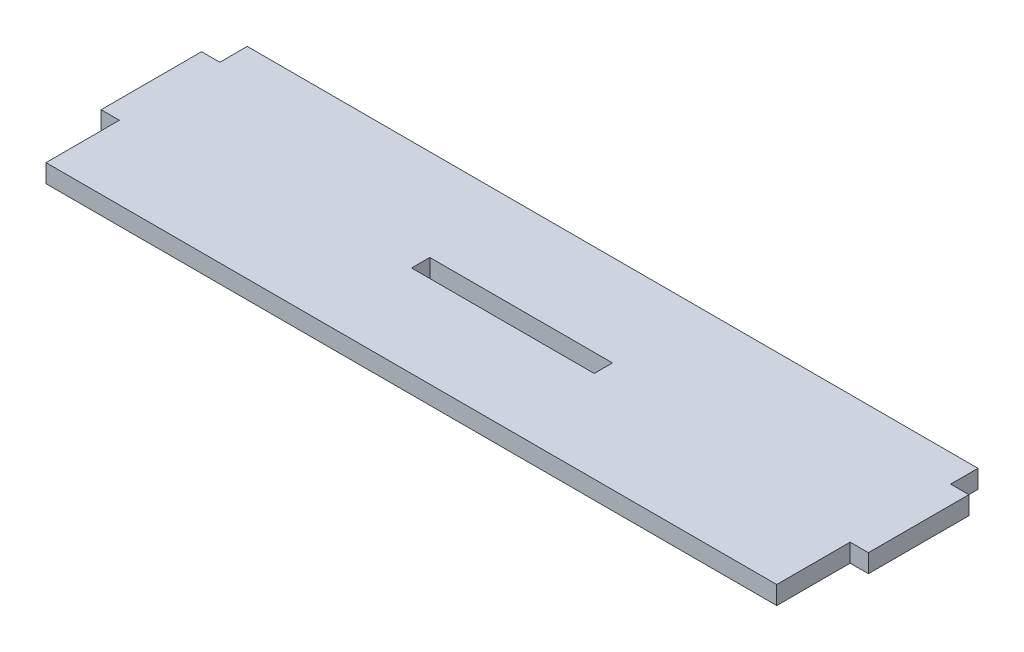
ISO-10303-21;
HEADER;
FILE_DESCRIPTION(('STEP AP214'),'2;1');
FILE_NAME('part.step','',(''),(''),'','','');
FILE_SCHEMA(('AUTOMOTIVE_DESIGN { 1 0 10303 214 1 1 1 1 }'));
ENDSEC;
DATA;
#1=APPLICATION_CONTEXT('core data for automotive mechanical design processes');
#2=APPLICATION_PROTOCOL_DEFINITION('international standard','automotive_design',2000,#1);
#3=PRODUCT_CONTEXT('',#1,'mechanical');
#4=PRODUCT('Part','Part','',(#3));
#5=PRODUCT_RELATED_PRODUCT_CATEGORY('part','',(#4));
#6=PRODUCT_DEFINITION_FORMATION('','',#4);
#7=PRODUCT_DEFINITION_CONTEXT('part definition',#1,'design');
#8=PRODUCT_DEFINITION('design','',#6,#7);
#9=PRODUCT_DEFINITION_SHAPE('','',#8);
#10=(LENGTH_UNIT() NAMED_UNIT(*) SI_UNIT(.MILLI.,.METRE.));
#11=(NAMED_UNIT(*) PLANE_ANGLE_UNIT() SI_UNIT($,.RADIAN.));
#12=(NAMED_UNIT(*) SI_UNIT($,.STERADIAN.) SOLID_ANGLE_UNIT());
#13=UNCERTAINTY_MEASURE_WITH_UNIT(LENGTH_MEASURE(1.E-05),#10,'distance_accuracy_value','');
#14=(GEOMETRIC_REPRESENTATION_CONTEXT(3) GLOBAL_UNCERTAINTY_ASSIGNED_CONTEXT((#13)) GLOBAL_UNIT_ASSIGNED_CONTEXT((#10,
#11,#12)) REPRESENTATION_CONTEXT('',''));
#15=CARTESIAN_POINT('',(0.,0.,0.));
#16=DIRECTION('',(0.,0.,1.));
#17=DIRECTION('',(1.,0.,0.));
#18=AXIS2_PLACEMENT_3D('',#15,#16,#17);
#19=CARTESIAN_POINT('',(0.,4.,0.));
#20=DIRECTION('',(0.,-1.,0.));
#21=DIRECTION('',(0.,0.,-1.));
#22=AXIS2_PLACEMENT_3D('',#19,#20,#21);
#23=PLANE('',#22);
#24=DIRECTION('',(0.,0.,1.));
#25=VECTOR('',#24,1.);
#26=CARTESIAN_POINT('',(0.,4.,0.));
#27=LINE('',#26,#25);
#28=CARTESIAN_POINT('',(0.,4.,0.));
#29=VERTEX_POINT('',#28);
#30=CARTESIAN_POINT('',(0.,4.,6.));
#31=VERTEX_POINT('',#30);
#32=EDGE_CURVE('E211',#29,#31,#27,.T.);
#33=ORIENTED_EDGE('',*,*,#32,.T.);
#34=DIRECTION('',(-1.,0.,0.));
#35=VECTOR('',#34,1.);
#36=CARTESIAN_POINT('',(0.,4.,6.));
#37=LINE('',#36,#35);
#38=CARTESIAN_POINT('',(-4.,4.,6.));
#39=VERTEX_POINT('',#38);
#40=EDGE_CURVE('E215',#31,#39,#37,.T.);
#41=ORIENTED_EDGE('',*,*,#40,.T.);
#42=DIRECTION('',(0.,0.,1.));
#43=VECTOR('',#42,1.);
#44=CARTESIAN_POINT('',(-4.,4.,6.));
#45=LINE('',#44,#43);
#46=CARTESIAN_POINT('',(-4.,4.,28.));
#47=VERTEX_POINT('',#46);
#48=EDGE_CURVE('E219',#39,#47,#45,.T.);
#49=ORIENTED_EDGE('',*,*,#48,.T.);
#50=DIRECTION('',(1.,0.,0.));
#51=VECTOR('',#50,1.);
#52=CARTESIAN_POINT('',(-4.,4.,28.));
#53=LINE('',#52,#51);
#54=CARTESIAN_POINT('',(0.,4.,28.));
#55=VERTEX_POINT('',#54);
#56=EDGE_CURVE('E222',#47,#55,#53,.T.);
#57=ORIENTED_EDGE('',*,*,#56,.T.);
#58=DIRECTION('',(0.,0.,1.));
#59=VECTOR('',#58,1.);
#60=CARTESIAN_POINT('',(0.,4.,28.));
#61=LINE('',#60,#59);
#62=CARTESIAN_POINT('',(0.,4.,44.07));
#63=VERTEX_POINT('',#62);
#64=EDGE_CURVE('E225',#55,#63,#61,.T.);
#65=ORIENTED_EDGE('',*,*,#64,.T.);
#66=DIRECTION('',(1.,0.,0.));
#67=VECTOR('',#66,1.);
#68=CARTESIAN_POINT('',(0.,4.,44.07));
#69=LINE('',#68,#67);
#70=CARTESIAN_POINT('',(160.,4.,44.07));
#71=VERTEX_POINT('',#70);
#72=EDGE_CURVE('E228',#63,#71,#69,.T.);
#73=ORIENTED_EDGE('',*,*,#72,.T.);
#74=DIRECTION('',(0.,0.,-1.));
#75=VECTOR('',#74,1.);
#76=CARTESIAN_POINT('',(160.,4.,28.));
#77=LINE('',#76,#75);
#78=CARTESIAN_POINT('',(160.,4.,28.));
#79=VERTEX_POINT('',#78);
#80=EDGE_CURVE('E231',#71,#79,#77,.T.);
#81=ORIENTED_EDGE('',*,*,#80,.T.);
#82=DIRECTION('',(1.,0.,0.));
#83=VECTOR('',#82,1.);
#84=CARTESIAN_POINT('',(164.,4.,28.));
#85=LINE('',#84,#83);
#86=CARTESIAN_POINT('',(164.,4.,28.));
#87=VERTEX_POINT('',#86);
#88=EDGE_CURVE('E234',#79,#87,#85,.T.);
#89=ORIENTED_EDGE('',*,*,#88,.T.);
#90=DIRECTION('',(0.,0.,-1.));
#91=VECTOR('',#90,1.);
#92=CARTESIAN_POINT('',(164.,4.,5.99999999999998));
#93=LINE('',#92,#91);
#94=CARTESIAN_POINT('',(164.,4.,5.99999999999998));
#95=VERTEX_POINT('',#94);
#96=EDGE_CURVE('E237',#87,#95,#93,.T.);
#97=ORIENTED_EDGE('',*,*,#96,.T.);
#98=DIRECTION('',(-1.,0.,0.));
#99=VECTOR('',#98,1.);
#100=CARTESIAN_POINT('',(160.,4.,5.99999999999998));
#101=LINE('',#100,#99);
#102=CARTESIAN_POINT('',(160.,4.,5.99999999999998));
#103=VERTEX_POINT('',#102);
#104=EDGE_CURVE('E240',#95,#103,#101,.T.);
#105=ORIENTED_EDGE('',*,*,#104,.T.);
#106=DIRECTION('',(0.,0.,-1.));
#107=VECTOR('',#106,1.);
#108=CARTESIAN_POINT('',(160.,4.,0.));
#109=LINE('',#108,#107);
#110=CARTESIAN_POINT('',(160.,4.,0.));
#111=VERTEX_POINT('',#110);
#112=EDGE_CURVE('E243',#103,#111,#109,.T.);
#113=ORIENTED_EDGE('',*,*,#112,.T.);
#114=DIRECTION('',(-1.,0.,0.));
#115=VECTOR('',#114,1.);
#116=CARTESIAN_POINT('',(0.,4.,0.));
#117=LINE('',#116,#115);
#118=EDGE_CURVE('E246',#111,#29,#117,.T.);
#119=ORIENTED_EDGE('',*,*,#118,.T.);
#120=EDGE_LOOP('',(#33,#41,#49,#57,#65,#73,#81,#89,#97,#105,#113,#119));
#121=FACE_BOUND('',#120,.T.);
#122=DIRECTION('',(1.,0.,0.));
#123=VECTOR('',#122,1.);
#124=CARTESIAN_POINT('',(60.,4.,24.035));
#125=LINE('',#124,#123);
#126=CARTESIAN_POINT('',(60.,4.,24.035));
#127=VERTEX_POINT('',#126);
#128=CARTESIAN_POINT('',(100.,4.,24.035));
#129=VERTEX_POINT('',#128);
#130=EDGE_CURVE('E163',#127,#129,#125,.T.);
#131=ORIENTED_EDGE('',*,*,#130,.F.);
#132=DIRECTION('',(0.,0.,1.));
#133=VECTOR('',#132,1.);
#134=CARTESIAN_POINT('',(60.,4.,20.035));
#135=LINE('',#134,#133);
#136=CARTESIAN_POINT('',(60.,4.,20.035));
#137=VERTEX_POINT('',#136);
#138=EDGE_CURVE('E189',#137,#127,#135,.T.);
#139=ORIENTED_EDGE('',*,*,#138,.F.);
#140=DIRECTION('',(-1.,0.,0.));
#141=VECTOR('',#140,1.);
#142=CARTESIAN_POINT('',(60.,4.,20.035));
#143=LINE('',#142,#141);
#144=CARTESIAN_POINT('',(100.,4.,20.035));
#145=VERTEX_POINT('',#144);
#146=EDGE_CURVE('E185',#145,#137,#143,.T.);
#147=ORIENTED_EDGE('',*,*,#146,.F.);
#148=DIRECTION('',(0.,0.,-1.));
#149=VECTOR('',#148,1.);
#150=CARTESIAN_POINT('',(100.,4.,20.035));
#151=LINE('',#150,#149);
#152=EDGE_CURVE('E172',#129,#145,#151,.T.);
#153=ORIENTED_EDGE('',*,*,#152,.F.);
#154=EDGE_LOOP('',(#131,#139,#147,#153));
#155=FACE_BOUND('',#154,.T.);
#156=ADVANCED_FACE('F49',(#121,#155),#23,.F.);
#157=CARTESIAN_POINT('',(0.,0.,0.));
#158=DIRECTION('',(0.,-1.,0.));
#159=DIRECTION('',(0.,0.,-1.));
#160=AXIS2_PLACEMENT_3D('',#157,#158,#159);
#161=PLANE('',#160);
#162=DIRECTION('',(0.,0.,1.));
#163=VECTOR('',#162,1.);
#164=CARTESIAN_POINT('',(0.,0.,0.));
#165=LINE('',#164,#163);
#166=CARTESIAN_POINT('',(0.,0.,0.));
#167=VERTEX_POINT('',#166);
#168=CARTESIAN_POINT('',(0.,0.,6.));
#169=VERTEX_POINT('',#168);
#170=EDGE_CURVE('E181',#167,#169,#165,.T.);
#171=ORIENTED_EDGE('',*,*,#170,.F.);
#172=DIRECTION('',(-1.,0.,0.));
#173=VECTOR('',#172,1.);
#174=CARTESIAN_POINT('',(0.,0.,0.));
#175=LINE('',#174,#173);
#176=CARTESIAN_POINT('',(160.,0.,0.));
#177=VERTEX_POINT('',#176);
#178=EDGE_CURVE('E216',#177,#167,#175,.T.);
#179=ORIENTED_EDGE('',*,*,#178,.F.);
#180=DIRECTION('',(0.,0.,-1.));
#181=VECTOR('',#180,1.);
#182=CARTESIAN_POINT('',(160.,0.,0.));
#183=LINE('',#182,#181);
#184=CARTESIAN_POINT('',(160.,0.,5.99999999999998));
#185=VERTEX_POINT('',#184);
#186=EDGE_CURVE('E280',#185,#177,#183,.T.);
#187=ORIENTED_EDGE('',*,*,#186,.F.);
#188=DIRECTION('',(-1.,0.,0.));
#189=VECTOR('',#188,1.);
#190=CARTESIAN_POINT('',(160.,0.,5.99999999999998));
#191=LINE('',#190,#189);
#192=CARTESIAN_POINT('',(164.,0.,5.99999999999998));
#193=VERTEX_POINT('',#192);
#194=EDGE_CURVE('E277',#193,#185,#191,.T.);
#195=ORIENTED_EDGE('',*,*,#194,.F.);
#196=DIRECTION('',(0.,0.,-1.));
#197=VECTOR('',#196,1.);
#198=CARTESIAN_POINT('',(164.,0.,5.99999999999998));
#199=LINE('',#198,#197);
#200=CARTESIAN_POINT('',(164.,0.,28.));
#201=VERTEX_POINT('',#200);
#202=EDGE_CURVE('E274',#201,#193,#199,.T.);
#203=ORIENTED_EDGE('',*,*,#202,.F.);
#204=DIRECTION('',(1.,0.,0.));
#205=VECTOR('',#204,1.);
#206=CARTESIAN_POINT('',(164.,0.,28.));
#207=LINE('',#206,#205);
#208=CARTESIAN_POINT('',(160.,0.,28.));
#209=VERTEX_POINT('',#208);
#210=EDGE_CURVE('E271',#209,#201,#207,.T.);
#211=ORIENTED_EDGE('',*,*,#210,.F.);
#212=DIRECTION('',(0.,0.,-1.));
#213=VECTOR('',#212,1.);
#214=CARTESIAN_POINT('',(160.,0.,28.));
#215=LINE('',#214,#213);
#216=CARTESIAN_POINT('',(160.,0.,44.07));
#217=VERTEX_POINT('',#216);
#218=EDGE_CURVE('E268',#217,#209,#215,.T.);
#219=ORIENTED_EDGE('',*,*,#218,.F.);
#220=DIRECTION('',(1.,0.,0.));
#221=VECTOR('',#220,1.);
#222=CARTESIAN_POINT('',(0.,0.,44.07));
#223=LINE('',#222,#221);
#224=CARTESIAN_POINT('',(0.,0.,44.07));
#225=VERTEX_POINT('',#224);
#226=EDGE_CURVE('E265',#225,#217,#223,.T.);
#227=ORIENTED_EDGE('',*,*,#226,.F.);
#228=DIRECTION('',(0.,0.,1.));
#229=VECTOR('',#228,1.);
#230=CARTESIAN_POINT('',(0.,0.,28.));
#231=LINE('',#230,#229);
#232=CARTESIAN_POINT('',(0.,0.,28.));
#233=VERTEX_POINT('',#232);
#234=EDGE_CURVE('E262',#233,#225,#231,.T.);
#235=ORIENTED_EDGE('',*,*,#234,.F.);
#236=DIRECTION('',(1.,0.,0.));
#237=VECTOR('',#236,1.);
#238=CARTESIAN_POINT('',(-4.,0.,28.));
#239=LINE('',#238,#237);
#240=CARTESIAN_POINT('',(-4.,0.,28.));
#241=VERTEX_POINT('',#240);
#242=EDGE_CURVE('E259',#241,#233,#239,.T.);
#243=ORIENTED_EDGE('',*,*,#242,.F.);
#244=DIRECTION('',(0.,0.,1.));
#245=VECTOR('',#244,1.);
#246=CARTESIAN_POINT('',(-4.,0.,6.));
#247=LINE('',#246,#245);
#248=CARTESIAN_POINT('',(-4.,0.,6.));
#249=VERTEX_POINT('',#248);
#250=EDGE_CURVE('E256',#249,#241,#247,.T.);
#251=ORIENTED_EDGE('',*,*,#250,.F.);
#252=DIRECTION('',(-1.,0.,0.));
#253=VECTOR('',#252,1.);
#254=CARTESIAN_POINT('',(0.,0.,6.));
#255=LINE('',#254,#253);
#256=EDGE_CURVE('E253',#169,#249,#255,.T.);
#257=ORIENTED_EDGE('',*,*,#256,.F.);
#258=EDGE_LOOP('',(#171,#179,#187,#195,#203,#211,#219,#227,#235,#243,#251,#257));
#259=FACE_BOUND('',#258,.T.);
#260=DIRECTION('',(0.,0.,1.));
#261=VECTOR('',#260,1.);
#262=CARTESIAN_POINT('',(60.,0.,20.035));
#263=LINE('',#262,#261);
#264=CARTESIAN_POINT('',(60.,0.,20.035));
#265=VERTEX_POINT('',#264);
#266=CARTESIAN_POINT('',(60.,0.,24.035));
#267=VERTEX_POINT('',#266);
#268=EDGE_CURVE('E173',#265,#267,#263,.T.);
#269=ORIENTED_EDGE('',*,*,#268,.T.);
#270=DIRECTION('',(1.,0.,0.));
#271=VECTOR('',#270,1.);
#272=CARTESIAN_POINT('',(60.,0.,24.035));
#273=LINE('',#272,#271);
#274=CARTESIAN_POINT('',(100.,0.,24.035));
#275=VERTEX_POINT('',#274);
#276=EDGE_CURVE('E73',#267,#275,#273,.T.);
#277=ORIENTED_EDGE('',*,*,#276,.T.);
#278=DIRECTION('',(0.,0.,-1.));
#279=VECTOR('',#278,1.);
#280=CARTESIAN_POINT('',(100.,0.,20.035));
#281=LINE('',#280,#279);
#282=CARTESIAN_POINT('',(100.,0.,20.035));
#283=VERTEX_POINT('',#282);
#284=EDGE_CURVE('E179',#275,#283,#281,.T.);
#285=ORIENTED_EDGE('',*,*,#284,.T.);
#286=DIRECTION('',(-1.,0.,0.));
#287=VECTOR('',#286,1.);
#288=CARTESIAN_POINT('',(60.,0.,20.035));
#289=LINE('',#288,#287);
#290=EDGE_CURVE('E198',#283,#265,#289,.T.);
#291=ORIENTED_EDGE('',*,*,#290,.T.);
#292=EDGE_LOOP('',(#269,#277,#285,#291));
#293=FACE_BOUND('',#292,.T.);
#294=ADVANCED_FACE('F335',(#259,#293),#161,.T.);
#295=CARTESIAN_POINT('',(0.,4.,0.));
#296=DIRECTION('',(1.,0.,0.));
#297=DIRECTION('',(0.,0.,-1.));
#298=AXIS2_PLACEMENT_3D('',#295,#296,#297);
#299=PLANE('',#298);
#300=ORIENTED_EDGE('',*,*,#170,.T.);
#301=DIRECTION('',(0.,-1.,0.));
#302=VECTOR('',#301,1.);
#303=CARTESIAN_POINT('',(0.,4.,6.));
#304=LINE('',#303,#302);
#305=EDGE_CURVE('E11',#31,#169,#304,.T.);
#306=ORIENTED_EDGE('',*,*,#305,.F.);
#307=ORIENTED_EDGE('',*,*,#32,.F.);
#308=DIRECTION('',(0.,-1.,0.));
#309=VECTOR('',#308,1.);
#310=CARTESIAN_POINT('',(0.,4.,0.));
#311=LINE('',#310,#309);
#312=EDGE_CURVE('E249',#29,#167,#311,.T.);
#313=ORIENTED_EDGE('',*,*,#312,.T.);
#314=EDGE_LOOP('',(#300,#306,#307,#313));
#315=FACE_BOUND('',#314,.T.);
#316=ADVANCED_FACE('F51',(#315),#299,.F.);
#317=CARTESIAN_POINT('',(0.,4.,6.));
#318=DIRECTION('',(0.,0.,1.));
#319=DIRECTION('',(1.,0.,0.));
#320=AXIS2_PLACEMENT_3D('',#317,#318,#319);
#321=PLANE('',#320);
#322=ORIENTED_EDGE('',*,*,#256,.T.);
#323=DIRECTION('',(0.,-1.,0.));
#324=VECTOR('',#323,1.);
#325=CARTESIAN_POINT('',(-4.,4.,6.));
#326=LINE('',#325,#324);
#327=EDGE_CURVE('E58',#39,#249,#326,.T.);
#328=ORIENTED_EDGE('',*,*,#327,.F.);
#329=ORIENTED_EDGE('',*,*,#40,.F.);
#330=ORIENTED_EDGE('',*,*,#305,.T.);
#331=EDGE_LOOP('',(#322,#328,#329,#330));
#332=FACE_BOUND('',#331,.T.);
#333=ADVANCED_FACE('F352',(#332),#321,.F.);
#334=CARTESIAN_POINT('',(-4.,4.,6.));
#335=DIRECTION('',(1.,0.,0.));
#336=DIRECTION('',(0.,0.,-1.));
#337=AXIS2_PLACEMENT_3D('',#334,#335,#336);
#338=PLANE('',#337);
#339=ORIENTED_EDGE('',*,*,#250,.T.);
#340=DIRECTION('',(0.,-1.,0.));
#341=VECTOR('',#340,1.);
#342=CARTESIAN_POINT('',(-4.,4.,28.));
#343=LINE('',#342,#341);
#344=EDGE_CURVE('E320',#47,#241,#343,.T.);
#345=ORIENTED_EDGE('',*,*,#344,.F.);
#346=ORIENTED_EDGE('',*,*,#48,.F.);
#347=ORIENTED_EDGE('',*,*,#327,.T.);
#348=EDGE_LOOP('',(#339,#345,#346,#347));
#349=FACE_BOUND('',#348,.T.);
#350=ADVANCED_FACE('F329',(#349),#338,.F.);
#351=CARTESIAN_POINT('',(-4.,4.,28.));
#352=DIRECTION('',(0.,0.,-1.));
#353=DIRECTION('',(-1.,0.,0.));
#354=AXIS2_PLACEMENT_3D('',#351,#352,#353);
#355=PLANE('',#354);
#356=ORIENTED_EDGE('',*,*,#242,.T.);
#357=DIRECTION('',(0.,-1.,0.));
#358=VECTOR('',#357,1.);
#359=CARTESIAN_POINT('',(0.,4.,28.));
#360=LINE('',#359,#358);
#361=EDGE_CURVE('E316',#55,#233,#360,.T.);
#362=ORIENTED_EDGE('',*,*,#361,.F.);
#363=ORIENTED_EDGE('',*,*,#56,.F.);
#364=ORIENTED_EDGE('',*,*,#344,.T.);
#365=EDGE_LOOP('',(#356,#362,#363,#364));
#366=FACE_BOUND('',#365,.T.);
#367=ADVANCED_FACE('F341',(#366),#355,.F.);
#368=CARTESIAN_POINT('',(0.,4.,28.));
#369=DIRECTION('',(1.,0.,0.));
#370=DIRECTION('',(0.,0.,-1.));
#371=AXIS2_PLACEMENT_3D('',#368,#369,#370);
#372=PLANE('',#371);
#373=ORIENTED_EDGE('',*,*,#234,.T.);
#374=DIRECTION('',(0.,-1.,0.));
#375=VECTOR('',#374,1.);
#376=CARTESIAN_POINT('',(0.,4.,44.07));
#377=LINE('',#376,#375);
#378=EDGE_CURVE('E312',#63,#225,#377,.T.);
#379=ORIENTED_EDGE('',*,*,#378,.F.);
#380=ORIENTED_EDGE('',*,*,#64,.F.);
#381=ORIENTED_EDGE('',*,*,#361,.T.);
#382=EDGE_LOOP('',(#373,#379,#380,#381));
#383=FACE_BOUND('',#382,.T.);
#384=ADVANCED_FACE('F345',(#383),#372,.F.);
#385=CARTESIAN_POINT('',(0.,4.,44.07));
#386=DIRECTION('',(0.,0.,-1.));
#387=DIRECTION('',(-1.,0.,0.));
#388=AXIS2_PLACEMENT_3D('',#385,#386,#387);
#389=PLANE('',#388);
#390=ORIENTED_EDGE('',*,*,#226,.T.);
#391=DIRECTION('',(0.,-1.,0.));
#392=VECTOR('',#391,1.);
#393=CARTESIAN_POINT('',(160.,4.,44.07));
#394=LINE('',#393,#392);
#395=EDGE_CURVE('E308',#71,#217,#394,.T.);
#396=ORIENTED_EDGE('',*,*,#395,.F.);
#397=ORIENTED_EDGE('',*,*,#72,.F.);
#398=ORIENTED_EDGE('',*,*,#378,.T.);
#399=EDGE_LOOP('',(#390,#396,#397,#398));
#400=FACE_BOUND('',#399,.T.);
#401=ADVANCED_FACE('F385',(#400),#389,.F.);
#402=CARTESIAN_POINT('',(160.,4.,28.));
#403=DIRECTION('',(-1.,0.,0.));
#404=DIRECTION('',(0.,0.,1.));
#405=AXIS2_PLACEMENT_3D('',#402,#403,#404);
#406=PLANE('',#405);
#407=ORIENTED_EDGE('',*,*,#218,.T.);
#408=DIRECTION('',(0.,-1.,0.));
#409=VECTOR('',#408,1.);
#410=CARTESIAN_POINT('',(160.,4.,28.));
#411=LINE('',#410,#409);
#412=EDGE_CURVE('E304',#79,#209,#411,.T.);
#413=ORIENTED_EDGE('',*,*,#412,.F.);
#414=ORIENTED_EDGE('',*,*,#80,.F.);
#415=ORIENTED_EDGE('',*,*,#395,.T.);
#416=EDGE_LOOP('',(#407,#413,#414,#415));
#417=FACE_BOUND('',#416,.T.);
#418=ADVANCED_FACE('F383',(#417),#406,.F.);
#419=CARTESIAN_POINT('',(164.,4.,28.));
#420=DIRECTION('',(0.,0.,-1.));
#421=DIRECTION('',(-1.,0.,0.));
#422=AXIS2_PLACEMENT_3D('',#419,#420,#421);
#423=PLANE('',#422);
#424=ORIENTED_EDGE('',*,*,#210,.T.);
#425=DIRECTION('',(0.,-1.,0.));
#426=VECTOR('',#425,1.);
#427=CARTESIAN_POINT('',(164.,4.,28.));
#428=LINE('',#427,#426);
#429=EDGE_CURVE('E300',#87,#201,#428,.T.);
#430=ORIENTED_EDGE('',*,*,#429,.F.);
#431=ORIENTED_EDGE('',*,*,#88,.F.);
#432=ORIENTED_EDGE('',*,*,#412,.T.);
#433=EDGE_LOOP('',(#424,#430,#431,#432));
#434=FACE_BOUND('',#433,.T.);
#435=ADVANCED_FACE('F379',(#434),#423,.F.);
#436=CARTESIAN_POINT('',(164.,4.,5.99999999999998));
#437=DIRECTION('',(-1.,0.,0.));
#438=DIRECTION('',(0.,0.,1.));
#439=AXIS2_PLACEMENT_3D('',#436,#437,#438);
#440=PLANE('',#439);
#441=ORIENTED_EDGE('',*,*,#202,.T.);
#442=DIRECTION('',(0.,-1.,0.));
#443=VECTOR('',#442,1.);
#444=CARTESIAN_POINT('',(164.,4.,5.99999999999998));
#445=LINE('',#444,#443);
#446=EDGE_CURVE('E296',#95,#193,#445,.T.);
#447=ORIENTED_EDGE('',*,*,#446,.F.);
#448=ORIENTED_EDGE('',*,*,#96,.F.);
#449=ORIENTED_EDGE('',*,*,#429,.T.);
#450=EDGE_LOOP('',(#441,#447,#448,#449));
#451=FACE_BOUND('',#450,.T.);
#452=ADVANCED_FACE('F374',(#451),#440,.F.);
#453=CARTESIAN_POINT('',(160.,4.,5.99999999999998));
#454=DIRECTION('',(0.,0.,1.));
#455=DIRECTION('',(1.,0.,0.));
#456=AXIS2_PLACEMENT_3D('',#453,#454,#455);
#457=PLANE('',#456);
#458=ORIENTED_EDGE('',*,*,#194,.T.);
#459=DIRECTION('',(0.,-1.,0.));
#460=VECTOR('',#459,1.);
#461=CARTESIAN_POINT('',(160.,4.,5.99999999999998));
#462=LINE('',#461,#460);
#463=EDGE_CURVE('E292',#103,#185,#462,.T.);
#464=ORIENTED_EDGE('',*,*,#463,.F.);
#465=ORIENTED_EDGE('',*,*,#104,.F.);
#466=ORIENTED_EDGE('',*,*,#446,.T.);
#467=EDGE_LOOP('',(#458,#464,#465,#466));
#468=FACE_BOUND('',#467,.T.);
#469=ADVANCED_FACE('F368',(#468),#457,.F.);
#470=CARTESIAN_POINT('',(160.,4.,0.));
#471=DIRECTION('',(-1.,0.,0.));
#472=DIRECTION('',(0.,0.,1.));
#473=AXIS2_PLACEMENT_3D('',#470,#471,#472);
#474=PLANE('',#473);
#475=ORIENTED_EDGE('',*,*,#186,.T.);
#476=DIRECTION('',(0.,-1.,0.));
#477=VECTOR('',#476,1.);
#478=CARTESIAN_POINT('',(160.,4.,0.));
#479=LINE('',#478,#477);
#480=EDGE_CURVE('E288',#111,#177,#479,.T.);
#481=ORIENTED_EDGE('',*,*,#480,.F.);
#482=ORIENTED_EDGE('',*,*,#112,.F.);
#483=ORIENTED_EDGE('',*,*,#463,.T.);
#484=EDGE_LOOP('',(#475,#481,#482,#483));
#485=FACE_BOUND('',#484,.T.);
#486=ADVANCED_FACE('F364',(#485),#474,.F.);
#487=CARTESIAN_POINT('',(0.,4.,0.));
#488=DIRECTION('',(0.,0.,1.));
#489=DIRECTION('',(1.,0.,0.));
#490=AXIS2_PLACEMENT_3D('',#487,#488,#489);
#491=PLANE('',#490);
#492=ORIENTED_EDGE('',*,*,#178,.T.);
#493=ORIENTED_EDGE('',*,*,#312,.F.);
#494=ORIENTED_EDGE('',*,*,#118,.F.);
#495=ORIENTED_EDGE('',*,*,#480,.T.);
#496=EDGE_LOOP('',(#492,#493,#494,#495));
#497=FACE_BOUND('',#496,.T.);
#498=ADVANCED_FACE('F359',(#497),#491,.F.);
#499=CARTESIAN_POINT('',(60.,4.,24.035));
#500=DIRECTION('',(0.,0.,-1.));
#501=DIRECTION('',(-1.,0.,0.));
#502=AXIS2_PLACEMENT_3D('',#499,#500,#501);
#503=PLANE('',#502);
#504=ORIENTED_EDGE('',*,*,#276,.F.);
#505=DIRECTION('',(0.,-1.,0.));
#506=VECTOR('',#505,1.);
#507=CARTESIAN_POINT('',(60.,4.,24.035));
#508=LINE('',#507,#506);
#509=EDGE_CURVE('E167',#127,#267,#508,.T.);
#510=ORIENTED_EDGE('',*,*,#509,.F.);
#511=ORIENTED_EDGE('',*,*,#130,.T.);
#512=DIRECTION('',(0.,-1.,0.));
#513=VECTOR('',#512,1.);
#514=CARTESIAN_POINT('',(100.,4.,24.035));
#515=LINE('',#514,#513);
#516=EDGE_CURVE('E166',#129,#275,#515,.T.);
#517=ORIENTED_EDGE('',*,*,#516,.T.);
#518=EDGE_LOOP('',(#504,#510,#511,#517));
#519=FACE_BOUND('',#518,.T.);
#520=ADVANCED_FACE('F165',(#519),#503,.T.);
#521=CARTESIAN_POINT('',(100.,4.,20.035));
#522=DIRECTION('',(-1.,0.,0.));
#523=DIRECTION('',(0.,0.,1.));
#524=AXIS2_PLACEMENT_3D('',#521,#522,#523);
#525=PLANE('',#524);
#526=ORIENTED_EDGE('',*,*,#284,.F.);
#527=ORIENTED_EDGE('',*,*,#516,.F.);
#528=ORIENTED_EDGE('',*,*,#152,.T.);
#529=DIRECTION('',(0.,-1.,0.));
#530=VECTOR('',#529,1.);
#531=CARTESIAN_POINT('',(100.,4.,20.035));
#532=LINE('',#531,#530);
#533=EDGE_CURVE('E182',#145,#283,#532,.T.);
#534=ORIENTED_EDGE('',*,*,#533,.T.);
#535=EDGE_LOOP('',(#526,#527,#528,#534));
#536=FACE_BOUND('',#535,.T.);
#537=ADVANCED_FACE('F176',(#536),#525,.T.);
#538=CARTESIAN_POINT('',(60.,4.,20.035));
#539=DIRECTION('',(0.,0.,1.));
#540=DIRECTION('',(1.,0.,0.));
#541=AXIS2_PLACEMENT_3D('',#538,#539,#540);
#542=PLANE('',#541);
#543=ORIENTED_EDGE('',*,*,#290,.F.);
#544=ORIENTED_EDGE('',*,*,#533,.F.);
#545=ORIENTED_EDGE('',*,*,#146,.T.);
#546=DIRECTION('',(0.,-1.,0.));
#547=VECTOR('',#546,1.);
#548=CARTESIAN_POINT('',(60.,4.,20.035));
#549=LINE('',#548,#547);
#550=EDGE_CURVE('E65',#137,#265,#549,.T.);
#551=ORIENTED_EDGE('',*,*,#550,.T.);
#552=EDGE_LOOP('',(#543,#544,#545,#551));
#553=FACE_BOUND('',#552,.T.);
#554=ADVANCED_FACE('F443',(#553),#542,.T.);
#555=CARTESIAN_POINT('',(60.,4.,20.035));
#556=DIRECTION('',(1.,0.,0.));
#557=DIRECTION('',(0.,0.,-1.));
#558=AXIS2_PLACEMENT_3D('',#555,#556,#557);
#559=PLANE('',#558);
#560=ORIENTED_EDGE('',*,*,#268,.F.);
#561=ORIENTED_EDGE('',*,*,#550,.F.);
#562=ORIENTED_EDGE('',*,*,#138,.T.);
#563=ORIENTED_EDGE('',*,*,#509,.T.);
#564=EDGE_LOOP('',(#560,#561,#562,#563));
#565=FACE_BOUND('',#564,.T.);
#566=ADVANCED_FACE('F449',(#565),#559,.T.);
#567=CLOSED_SHELL('',(#156,#294,#316,#333,#350,#367,#384,#401,#418,#435,#452,#469,#486,#498,
#520,#537,#554,#566));
#568=MANIFOLD_SOLID_BREP('B2',#567);
#569=ADVANCED_BREP_SHAPE_REPRESENTATION('',(#18,#568),#14);
#570=SHAPE_DEFINITION_REPRESENTATION(#9,#569);
ENDSEC;
END-ISO-10303-21;
